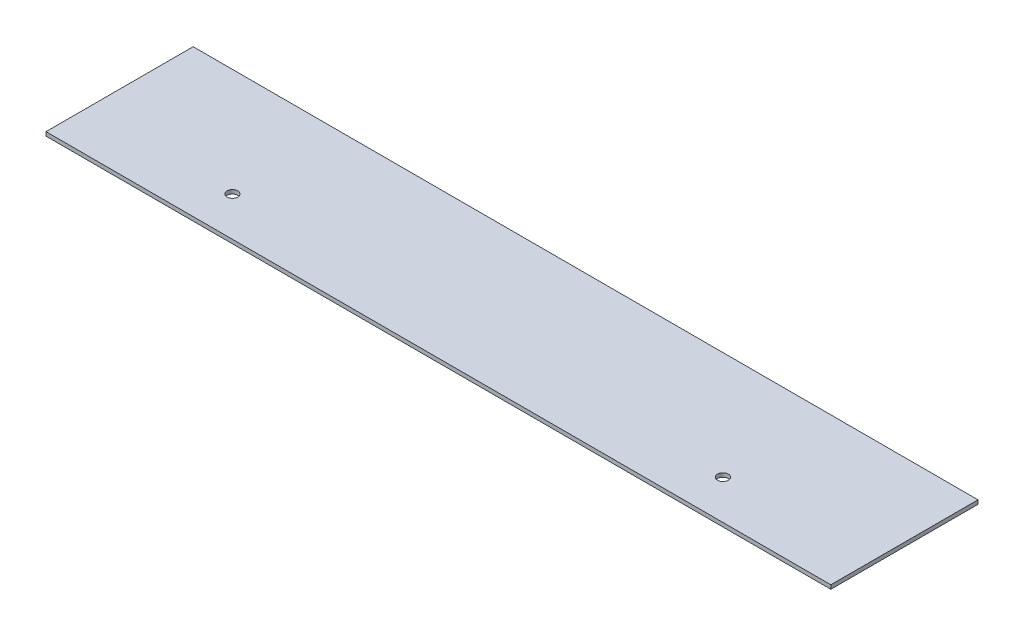
ISO-10303-21;
HEADER;
FILE_DESCRIPTION(('STEP AP214'),'2;1');
FILE_NAME('part.step','',(''),(''),'','','');
FILE_SCHEMA(('AUTOMOTIVE_DESIGN { 1 0 10303 214 1 1 1 1 }'));
ENDSEC;
DATA;
#1=APPLICATION_CONTEXT('core data for automotive mechanical design processes');
#2=APPLICATION_PROTOCOL_DEFINITION('international standard','automotive_design',2000,#1);
#3=PRODUCT_CONTEXT('',#1,'mechanical');
#4=PRODUCT('Part','Part','',(#3));
#5=PRODUCT_RELATED_PRODUCT_CATEGORY('part','',(#4));
#6=PRODUCT_DEFINITION_FORMATION('','',#4);
#7=PRODUCT_DEFINITION_CONTEXT('part definition',#1,'design');
#8=PRODUCT_DEFINITION('design','',#6,#7);
#9=PRODUCT_DEFINITION_SHAPE('','',#8);
#10=(LENGTH_UNIT() NAMED_UNIT(*) SI_UNIT(.MILLI.,.METRE.));
#11=(NAMED_UNIT(*) PLANE_ANGLE_UNIT() SI_UNIT($,.RADIAN.));
#12=(NAMED_UNIT(*) SI_UNIT($,.STERADIAN.) SOLID_ANGLE_UNIT());
#13=UNCERTAINTY_MEASURE_WITH_UNIT(LENGTH_MEASURE(1.E-05),#10,'distance_accuracy_value','');
#14=(GEOMETRIC_REPRESENTATION_CONTEXT(3) GLOBAL_UNCERTAINTY_ASSIGNED_CONTEXT((#13)) GLOBAL_UNIT_ASSIGNED_CONTEXT((#10,
#11,#12)) REPRESENTATION_CONTEXT('',''));
#15=CARTESIAN_POINT('',(0.,0.,0.));
#16=DIRECTION('',(0.,0.,1.));
#17=DIRECTION('',(1.,0.,0.));
#18=AXIS2_PLACEMENT_3D('',#15,#16,#17);
#19=CARTESIAN_POINT('',(0.,0.8,0.));
#20=DIRECTION('',(0.,-1.,0.));
#21=DIRECTION('',(0.,0.,-1.));
#22=AXIS2_PLACEMENT_3D('',#19,#20,#21);
#23=PLANE('',#22);
#24=DIRECTION('',(0.,0.,1.));
#25=VECTOR('',#24,1.);
#26=CARTESIAN_POINT('',(0.,0.8,0.));
#27=LINE('',#26,#25);
#28=CARTESIAN_POINT('',(0.,0.8,-30.));
#29=VERTEX_POINT('',#28);
#30=CARTESIAN_POINT('',(0.,0.8,0.));
#31=VERTEX_POINT('',#30);
#32=EDGE_CURVE('E92',#29,#31,#27,.T.);
#33=ORIENTED_EDGE('',*,*,#32,.T.);
#34=DIRECTION('',(1.,0.,0.));
#35=VECTOR('',#34,1.);
#36=CARTESIAN_POINT('',(0.,0.8,0.));
#37=LINE('',#36,#35);
#38=CARTESIAN_POINT('',(160.,0.8,0.));
#39=VERTEX_POINT('',#38);
#40=EDGE_CURVE('E87',#31,#39,#37,.T.);
#41=ORIENTED_EDGE('',*,*,#40,.T.);
#42=DIRECTION('',(0.,0.,-1.));
#43=VECTOR('',#42,1.);
#44=CARTESIAN_POINT('',(160.,0.8,0.));
#45=LINE('',#44,#43);
#46=CARTESIAN_POINT('',(160.,0.8,-30.));
#47=VERTEX_POINT('',#46);
#48=EDGE_CURVE('E90',#39,#47,#45,.T.);
#49=ORIENTED_EDGE('',*,*,#48,.T.);
#50=DIRECTION('',(-1.,0.,0.));
#51=VECTOR('',#50,1.);
#52=CARTESIAN_POINT('',(0.,0.8,-30.));
#53=LINE('',#52,#51);
#54=EDGE_CURVE('E57',#47,#29,#53,.T.);
#55=ORIENTED_EDGE('',*,*,#54,.T.);
#56=EDGE_LOOP('',(#33,#41,#49,#55));
#57=FACE_BOUND('',#56,.T.);
#58=CARTESIAN_POINT('',(30.,0.8,-8.));
#59=DIRECTION('',(0.,1.,0.));
#60=DIRECTION('',(0.,0.,1.));
#61=AXIS2_PLACEMENT_3D('',#58,#59,#60);
#62=CIRCLE('',#61,1.1);
#63=CARTESIAN_POINT('',(30.,0.8,-6.9));
#64=VERTEX_POINT('',#63);
#65=EDGE_CURVE('E112',#64,#64,#62,.T.);
#66=ORIENTED_EDGE('',*,*,#65,.F.);
#67=EDGE_LOOP('',(#66));
#68=FACE_BOUND('',#67,.T.);
#69=CARTESIAN_POINT('',(130.,0.8,-8.));
#70=DIRECTION('',(0.,1.,0.));
#71=DIRECTION('',(0.,0.,1.));
#72=AXIS2_PLACEMENT_3D('',#69,#70,#71);
#73=CIRCLE('',#72,1.10000000000002);
#74=CARTESIAN_POINT('',(130.,0.8,-6.89999999999998));
#75=VERTEX_POINT('',#74);
#76=EDGE_CURVE('E134',#75,#75,#73,.T.);
#77=ORIENTED_EDGE('',*,*,#76,.F.);
#78=EDGE_LOOP('',(#77));
#79=FACE_BOUND('',#78,.T.);
#80=ADVANCED_FACE('F39',(#57,#68,#79),#23,.F.);
#81=CARTESIAN_POINT('',(0.,0.,0.));
#82=DIRECTION('',(0.,-1.,0.));
#83=DIRECTION('',(0.,0.,-1.));
#84=AXIS2_PLACEMENT_3D('',#81,#82,#83);
#85=PLANE('',#84);
#86=CARTESIAN_POINT('',(30.,0.,-8.));
#87=DIRECTION('',(0.,1.,0.));
#88=DIRECTION('',(0.,0.,1.));
#89=AXIS2_PLACEMENT_3D('',#86,#87,#88);
#90=CIRCLE('',#89,1.1);
#91=CARTESIAN_POINT('',(30.,0.,-6.9));
#92=VERTEX_POINT('',#91);
#93=EDGE_CURVE('E130',#92,#92,#90,.T.);
#94=ORIENTED_EDGE('',*,*,#93,.T.);
#95=EDGE_LOOP('',(#94));
#96=FACE_BOUND('',#95,.T.);
#97=DIRECTION('',(0.,0.,1.));
#98=VECTOR('',#97,1.);
#99=CARTESIAN_POINT('',(0.,0.,0.));
#100=LINE('',#99,#98);
#101=CARTESIAN_POINT('',(0.,0.,-30.));
#102=VERTEX_POINT('',#101);
#103=CARTESIAN_POINT('',(0.,0.,0.));
#104=VERTEX_POINT('',#103);
#105=EDGE_CURVE('E108',#102,#104,#100,.T.);
#106=ORIENTED_EDGE('',*,*,#105,.F.);
#107=DIRECTION('',(-1.,0.,0.));
#108=VECTOR('',#107,1.);
#109=CARTESIAN_POINT('',(0.,0.,-30.));
#110=LINE('',#109,#108);
#111=CARTESIAN_POINT('',(160.,0.,-30.));
#112=VERTEX_POINT('',#111);
#113=EDGE_CURVE('E80',#112,#102,#110,.T.);
#114=ORIENTED_EDGE('',*,*,#113,.F.);
#115=DIRECTION('',(0.,0.,-1.));
#116=VECTOR('',#115,1.);
#117=CARTESIAN_POINT('',(160.,0.,0.));
#118=LINE('',#117,#116);
#119=CARTESIAN_POINT('',(160.,0.,0.));
#120=VERTEX_POINT('',#119);
#121=EDGE_CURVE('E74',#120,#112,#118,.T.);
#122=ORIENTED_EDGE('',*,*,#121,.F.);
#123=DIRECTION('',(1.,0.,0.));
#124=VECTOR('',#123,1.);
#125=CARTESIAN_POINT('',(0.,0.,0.));
#126=LINE('',#125,#124);
#127=EDGE_CURVE('E97',#104,#120,#126,.T.);
#128=ORIENTED_EDGE('',*,*,#127,.F.);
#129=EDGE_LOOP('',(#106,#114,#122,#128));
#130=FACE_BOUND('',#129,.T.);
#131=CARTESIAN_POINT('',(130.,0.,-8.));
#132=DIRECTION('',(0.,1.,0.));
#133=DIRECTION('',(0.,0.,1.));
#134=AXIS2_PLACEMENT_3D('',#131,#132,#133);
#135=CIRCLE('',#134,1.10000000000002);
#136=CARTESIAN_POINT('',(130.,0.,-6.89999999999998));
#137=VERTEX_POINT('',#136);
#138=EDGE_CURVE('E138',#137,#137,#135,.T.);
#139=ORIENTED_EDGE('',*,*,#138,.T.);
#140=EDGE_LOOP('',(#139));
#141=FACE_BOUND('',#140,.T.);
#142=ADVANCED_FACE('F125',(#96,#130,#141),#85,.T.);
#143=CARTESIAN_POINT('',(0.,0.8,0.));
#144=DIRECTION('',(1.,0.,0.));
#145=DIRECTION('',(0.,0.,-1.));
#146=AXIS2_PLACEMENT_3D('',#143,#144,#145);
#147=PLANE('',#146);
#148=ORIENTED_EDGE('',*,*,#105,.T.);
#149=DIRECTION('',(0.,-1.,0.));
#150=VECTOR('',#149,1.);
#151=CARTESIAN_POINT('',(0.,0.8,0.));
#152=LINE('',#151,#150);
#153=EDGE_CURVE('E11',#31,#104,#152,.T.);
#154=ORIENTED_EDGE('',*,*,#153,.F.);
#155=ORIENTED_EDGE('',*,*,#32,.F.);
#156=DIRECTION('',(0.,-1.,0.));
#157=VECTOR('',#156,1.);
#158=CARTESIAN_POINT('',(0.,0.8,-30.));
#159=LINE('',#158,#157);
#160=EDGE_CURVE('E104',#29,#102,#159,.T.);
#161=ORIENTED_EDGE('',*,*,#160,.T.);
#162=EDGE_LOOP('',(#148,#154,#155,#161));
#163=FACE_BOUND('',#162,.T.);
#164=ADVANCED_FACE('F41',(#163),#147,.F.);
#165=CARTESIAN_POINT('',(0.,0.8,0.));
#166=DIRECTION('',(0.,0.,-1.));
#167=DIRECTION('',(-1.,0.,0.));
#168=AXIS2_PLACEMENT_3D('',#165,#166,#167);
#169=PLANE('',#168);
#170=ORIENTED_EDGE('',*,*,#127,.T.);
#171=DIRECTION('',(0.,-1.,0.));
#172=VECTOR('',#171,1.);
#173=CARTESIAN_POINT('',(160.,0.8,0.));
#174=LINE('',#173,#172);
#175=EDGE_CURVE('E49',#39,#120,#174,.T.);
#176=ORIENTED_EDGE('',*,*,#175,.F.);
#177=ORIENTED_EDGE('',*,*,#40,.F.);
#178=ORIENTED_EDGE('',*,*,#153,.T.);
#179=EDGE_LOOP('',(#170,#176,#177,#178));
#180=FACE_BOUND('',#179,.T.);
#181=ADVANCED_FACE('F96',(#180),#169,.F.);
#182=CARTESIAN_POINT('',(160.,0.8,0.));
#183=DIRECTION('',(-1.,0.,0.));
#184=DIRECTION('',(0.,0.,1.));
#185=AXIS2_PLACEMENT_3D('',#182,#183,#184);
#186=PLANE('',#185);
#187=ORIENTED_EDGE('',*,*,#121,.T.);
#188=DIRECTION('',(0.,-1.,0.));
#189=VECTOR('',#188,1.);
#190=CARTESIAN_POINT('',(160.,0.8,-30.));
#191=LINE('',#190,#189);
#192=EDGE_CURVE('E99',#47,#112,#191,.T.);
#193=ORIENTED_EDGE('',*,*,#192,.F.);
#194=ORIENTED_EDGE('',*,*,#48,.F.);
#195=ORIENTED_EDGE('',*,*,#175,.T.);
#196=EDGE_LOOP('',(#187,#193,#194,#195));
#197=FACE_BOUND('',#196,.T.);
#198=ADVANCED_FACE('F100',(#197),#186,.F.);
#199=CARTESIAN_POINT('',(0.,0.8,-30.));
#200=DIRECTION('',(0.,0.,1.));
#201=DIRECTION('',(1.,0.,0.));
#202=AXIS2_PLACEMENT_3D('',#199,#200,#201);
#203=PLANE('',#202);
#204=ORIENTED_EDGE('',*,*,#113,.T.);
#205=ORIENTED_EDGE('',*,*,#160,.F.);
#206=ORIENTED_EDGE('',*,*,#54,.F.);
#207=ORIENTED_EDGE('',*,*,#192,.T.);
#208=EDGE_LOOP('',(#204,#205,#206,#207));
#209=FACE_BOUND('',#208,.T.);
#210=ADVANCED_FACE('F122',(#209),#203,.F.);
#211=CARTESIAN_POINT('',(30.,0.8,-8.));
#212=DIRECTION('',(0.,-1.,0.));
#213=DIRECTION('',(0.,0.,-1.));
#214=AXIS2_PLACEMENT_3D('',#211,#212,#213);
#215=CYLINDRICAL_SURFACE('',#214,1.1);
#216=ORIENTED_EDGE('',*,*,#65,.T.);
#217=EDGE_LOOP('',(#216));
#218=FACE_BOUND('',#217,.T.);
#219=ORIENTED_EDGE('',*,*,#93,.F.);
#220=EDGE_LOOP('',(#219));
#221=FACE_BOUND('',#220,.T.);
#222=ADVANCED_FACE('F157',(#218,#221),#215,.F.);
#223=CARTESIAN_POINT('',(130.,0.8,-8.));
#224=DIRECTION('',(0.,-1.,0.));
#225=DIRECTION('',(0.,0.,-1.));
#226=AXIS2_PLACEMENT_3D('',#223,#224,#225);
#227=CYLINDRICAL_SURFACE('',#226,1.10000000000002);
#228=ORIENTED_EDGE('',*,*,#76,.T.);
#229=EDGE_LOOP('',(#228));
#230=FACE_BOUND('',#229,.T.);
#231=ORIENTED_EDGE('',*,*,#138,.F.);
#232=EDGE_LOOP('',(#231));
#233=FACE_BOUND('',#232,.T.);
#234=ADVANCED_FACE('F146',(#230,#233),#227,.F.);
#235=CLOSED_SHELL('',(#80,#142,#164,#181,#198,#210,#222,#234));
#236=MANIFOLD_SOLID_BREP('B2',#235);
#237=ADVANCED_BREP_SHAPE_REPRESENTATION('',(#18,#236),#14);
#238=SHAPE_DEFINITION_REPRESENTATION(#9,#237);
ENDSEC;
END-ISO-10303-21;
